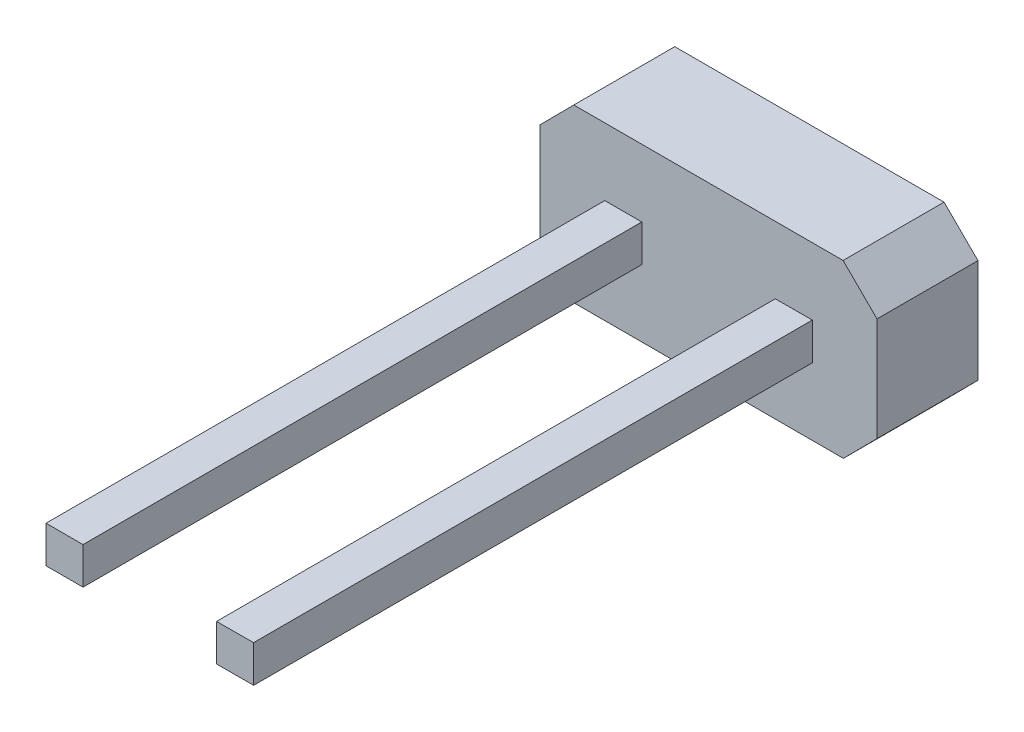
ISO-10303-21;
HEADER;
FILE_DESCRIPTION(('STEP AP214'),'2;1');
FILE_NAME('part.step','',(''),(''),'','','');
FILE_SCHEMA(('AUTOMOTIVE_DESIGN { 1 0 10303 214 1 1 1 1 }'));
ENDSEC;
DATA;
#1=APPLICATION_CONTEXT('core data for automotive mechanical design processes');
#2=APPLICATION_PROTOCOL_DEFINITION('international standard','automotive_design',2000,#1);
#3=PRODUCT_CONTEXT('',#1,'mechanical');
#4=PRODUCT('Part','Part','',(#3));
#5=PRODUCT_RELATED_PRODUCT_CATEGORY('part','',(#4));
#6=PRODUCT_DEFINITION_FORMATION('','',#4);
#7=PRODUCT_DEFINITION_CONTEXT('part definition',#1,'design');
#8=PRODUCT_DEFINITION('design','',#6,#7);
#9=PRODUCT_DEFINITION_SHAPE('','',#8);
#10=(LENGTH_UNIT() NAMED_UNIT(*) SI_UNIT(.MILLI.,.METRE.));
#11=(NAMED_UNIT(*) PLANE_ANGLE_UNIT() SI_UNIT($,.RADIAN.));
#12=(NAMED_UNIT(*) SI_UNIT($,.STERADIAN.) SOLID_ANGLE_UNIT());
#13=UNCERTAINTY_MEASURE_WITH_UNIT(LENGTH_MEASURE(1.E-05),#10,'distance_accuracy_value','');
#14=(GEOMETRIC_REPRESENTATION_CONTEXT(3) GLOBAL_UNCERTAINTY_ASSIGNED_CONTEXT((#13)) GLOBAL_UNIT_ASSIGNED_CONTEXT((#10,
#11,#12)) REPRESENTATION_CONTEXT('',''));
#15=CARTESIAN_POINT('',(0.,0.,0.));
#16=DIRECTION('',(0.,0.,1.));
#17=DIRECTION('',(1.,0.,0.));
#18=AXIS2_PLACEMENT_3D('',#15,#16,#17);
#19=CARTESIAN_POINT('',(0.,0.,1.5));
#20=DIRECTION('',(0.,0.,1.));
#21=DIRECTION('',(1.,0.,0.));
#22=AXIS2_PLACEMENT_3D('',#19,#20,#21);
#23=PLANE('',#22);
#24=DIRECTION('',(0.,-1.,0.));
#25=VECTOR('',#24,1.);
#26=CARTESIAN_POINT('',(-1.47372528281228,1.54408332644514,1.5));
#27=LINE('',#26,#25);
#28=CARTESIAN_POINT('',(-1.47372528281228,1.54408332644514,1.5));
#29=VERTEX_POINT('',#28);
#30=CARTESIAN_POINT('',(-1.47372528281228,0.995916673554858,1.5));
#31=VERTEX_POINT('',#30);
#32=EDGE_CURVE('E57',#29,#31,#27,.T.);
#33=ORIENTED_EDGE('',*,*,#32,.F.);
#34=DIRECTION('',(-1.,0.,0.));
#35=VECTOR('',#34,1.);
#36=CARTESIAN_POINT('',(-1.47372528281228,1.54408332644514,1.5));
#37=LINE('',#36,#35);
#38=CARTESIAN_POINT('',(-0.923725282812278,1.54408332644514,1.5));
#39=VERTEX_POINT('',#38);
#40=EDGE_CURVE('E182',#39,#29,#37,.T.);
#41=ORIENTED_EDGE('',*,*,#40,.F.);
#42=DIRECTION('',(0.,1.,0.));
#43=VECTOR('',#42,1.);
#44=CARTESIAN_POINT('',(-0.923725282812278,1.54408332644514,1.5));
#45=LINE('',#44,#43);
#46=CARTESIAN_POINT('',(-0.923725282812278,0.995916673554858,1.5));
#47=VERTEX_POINT('',#46);
#48=EDGE_CURVE('E191',#47,#39,#45,.T.);
#49=ORIENTED_EDGE('',*,*,#48,.F.);
#50=DIRECTION('',(1.,0.,0.));
#51=VECTOR('',#50,1.);
#52=CARTESIAN_POINT('',(-1.47372528281228,0.995916673554858,1.5));
#53=LINE('',#52,#51);
#54=EDGE_CURVE('E173',#31,#47,#53,.T.);
#55=ORIENTED_EDGE('',*,*,#54,.F.);
#56=EDGE_LOOP('',(#33,#41,#49,#55));
#57=FACE_BOUND('',#56,.T.);
#58=DIRECTION('',(0.709976516119919,-0.704225352112676,0.));
#59=VECTOR('',#58,1.);
#60=CARTESIAN_POINT('',(-2.43372528281228,0.5,1.5));
#61=LINE('',#60,#59);
#62=CARTESIAN_POINT('',(-2.43372528281228,0.5,1.5));
#63=VERTEX_POINT('',#62);
#64=CARTESIAN_POINT('',(-1.92964195636713,0.,1.5));
#65=VERTEX_POINT('',#64);
#66=EDGE_CURVE('E207',#63,#65,#61,.T.);
#67=ORIENTED_EDGE('',*,*,#66,.T.);
#68=DIRECTION('',(1.,0.,0.));
#69=VECTOR('',#68,1.);
#70=CARTESIAN_POINT('',(-1.92964195636713,0.,1.5));
#71=LINE('',#70,#69);
#72=CARTESIAN_POINT('',(2.07035804363286,0.,1.5));
#73=VERTEX_POINT('',#72);
#74=EDGE_CURVE('E210',#65,#73,#71,.T.);
#75=ORIENTED_EDGE('',*,*,#74,.T.);
#76=DIRECTION('',(0.704225352112676,0.709976516119919,0.));
#77=VECTOR('',#76,1.);
#78=CARTESIAN_POINT('',(2.07035804363286,0.,1.5));
#79=LINE('',#78,#77);
#80=CARTESIAN_POINT('',(2.57035804363286,0.504083326445142,1.5));
#81=VERTEX_POINT('',#80);
#82=EDGE_CURVE('E213',#73,#81,#79,.T.);
#83=ORIENTED_EDGE('',*,*,#82,.T.);
#84=DIRECTION('',(0.,1.,0.));
#85=VECTOR('',#84,1.);
#86=CARTESIAN_POINT('',(2.57035804363286,0.504083326445142,1.5));
#87=LINE('',#86,#85);
#88=CARTESIAN_POINT('',(2.57035804363286,2.04408332644514,1.5));
#89=VERTEX_POINT('',#88);
#90=EDGE_CURVE('E215',#81,#89,#87,.T.);
#91=ORIENTED_EDGE('',*,*,#90,.T.);
#92=DIRECTION('',(-0.709976516119919,0.704225352112676,0.));
#93=VECTOR('',#92,1.);
#94=CARTESIAN_POINT('',(2.57035804363286,2.04408332644514,1.5));
#95=LINE('',#94,#93);
#96=CARTESIAN_POINT('',(2.06627471718772,2.54408332644514,1.5));
#97=VERTEX_POINT('',#96);
#98=EDGE_CURVE('E217',#89,#97,#95,.T.);
#99=ORIENTED_EDGE('',*,*,#98,.T.);
#100=DIRECTION('',(-1.,0.,0.));
#101=VECTOR('',#100,1.);
#102=CARTESIAN_POINT('',(2.06627471718772,2.54408332644514,1.5));
#103=LINE('',#102,#101);
#104=CARTESIAN_POINT('',(-1.93372528281228,2.54408332644514,1.5));
#105=VERTEX_POINT('',#104);
#106=EDGE_CURVE('E219',#97,#105,#103,.T.);
#107=ORIENTED_EDGE('',*,*,#106,.T.);
#108=DIRECTION('',(-0.704225352112676,-0.709976516119919,0.));
#109=VECTOR('',#108,1.);
#110=CARTESIAN_POINT('',(-1.93372528281228,2.54408332644514,1.5));
#111=LINE('',#110,#109);
#112=CARTESIAN_POINT('',(-2.43372528281228,2.04,1.5));
#113=VERTEX_POINT('',#112);
#114=EDGE_CURVE('E221',#105,#113,#111,.T.);
#115=ORIENTED_EDGE('',*,*,#114,.T.);
#116=DIRECTION('',(0.,-1.,0.));
#117=VECTOR('',#116,1.);
#118=CARTESIAN_POINT('',(-2.43372528281228,2.04,1.5));
#119=LINE('',#118,#117);
#120=EDGE_CURVE('E223',#113,#63,#119,.T.);
#121=ORIENTED_EDGE('',*,*,#120,.T.);
#122=EDGE_LOOP('',(#67,#75,#83,#91,#99,#107,#115,#121));
#123=FACE_BOUND('',#122,.T.);
#124=DIRECTION('',(-0.999994847779797,-0.00321004888762787,0.));
#125=VECTOR('',#124,1.);
#126=CARTESIAN_POINT('',(1.60947683165624,1.54903195395229,1.5));
#127=LINE('',#126,#125);
#128=CARTESIAN_POINT('',(1.60947683165624,1.54903195395229,1.5));
#129=VERTEX_POINT('',#128);
#130=CARTESIAN_POINT('',(1.05947966537735,1.5472664270641,1.5));
#131=VERTEX_POINT('',#130);
#132=EDGE_CURVE('E476',#129,#131,#127,.T.);
#133=ORIENTED_EDGE('',*,*,#132,.F.);
#134=DIRECTION('',(-0.00321004888762844,0.999994847779797,0.));
#135=VECTOR('',#134,1.);
#136=CARTESIAN_POINT('',(1.60947683165624,1.54903195395229,1.5));
#137=LINE('',#136,#135);
#138=CARTESIAN_POINT('',(1.61123647341058,1.00086812533731,1.5));
#139=VERTEX_POINT('',#138);
#140=EDGE_CURVE('E170',#139,#129,#137,.T.);
#141=ORIENTED_EDGE('',*,*,#140,.F.);
#142=DIRECTION('',(0.999994847779797,0.00321004888762786,0.));
#143=VECTOR('',#142,1.);
#144=CARTESIAN_POINT('',(1.61123647341058,1.00086812533731,1.5));
#145=LINE('',#144,#143);
#146=CARTESIAN_POINT('',(1.0612393071317,0.999102598449117,1.5));
#147=VERTEX_POINT('',#146);
#148=EDGE_CURVE('E166',#147,#139,#145,.T.);
#149=ORIENTED_EDGE('',*,*,#148,.F.);
#150=DIRECTION('',(0.00321004888762765,-0.999994847779797,0.));
#151=VECTOR('',#150,1.);
#152=CARTESIAN_POINT('',(1.05947966537735,1.5472664270641,1.5));
#153=LINE('',#152,#151);
#154=EDGE_CURVE('E473',#131,#147,#153,.T.);
#155=ORIENTED_EDGE('',*,*,#154,.F.);
#156=EDGE_LOOP('',(#133,#141,#149,#155));
#157=FACE_BOUND('',#156,.T.);
#158=ADVANCED_FACE('F34',(#57,#123,#157),#23,.T.);
#159=CARTESIAN_POINT('',(-2.43372528281228,0.5,1.5));
#160=DIRECTION('',(0.704225352112676,0.709976516119919,0.));
#161=DIRECTION('',(-0.709976516119919,0.704225352112676,0.));
#162=AXIS2_PLACEMENT_3D('',#159,#160,#161);
#163=PLANE('',#162);
#164=DIRECTION('',(0.709976516119919,-0.704225352112676,0.));
#165=VECTOR('',#164,1.);
#166=CARTESIAN_POINT('',(-2.43372528281228,0.5,0.));
#167=LINE('',#166,#165);
#168=CARTESIAN_POINT('',(-2.43372528281228,0.5,0.));
#169=VERTEX_POINT('',#168);
#170=CARTESIAN_POINT('',(-1.92964195636713,0.,0.));
#171=VERTEX_POINT('',#170);
#172=EDGE_CURVE('E206',#169,#171,#167,.T.);
#173=ORIENTED_EDGE('',*,*,#172,.T.);
#174=DIRECTION('',(0.,0.,-1.));
#175=VECTOR('',#174,1.);
#176=CARTESIAN_POINT('',(-1.92964195636713,0.,1.5));
#177=LINE('',#176,#175);
#178=EDGE_CURVE('E11',#65,#171,#177,.T.);
#179=ORIENTED_EDGE('',*,*,#178,.F.);
#180=ORIENTED_EDGE('',*,*,#66,.F.);
#181=DIRECTION('',(0.,0.,-1.));
#182=VECTOR('',#181,1.);
#183=CARTESIAN_POINT('',(-2.43372528281228,0.5,1.5));
#184=LINE('',#183,#182);
#185=EDGE_CURVE('E225',#63,#169,#184,.T.);
#186=ORIENTED_EDGE('',*,*,#185,.T.);
#187=EDGE_LOOP('',(#173,#179,#180,#186));
#188=FACE_BOUND('',#187,.T.);
#189=ADVANCED_FACE('F36',(#188),#163,.F.);
#190=CARTESIAN_POINT('',(-1.92964195636713,0.,1.5));
#191=DIRECTION('',(0.,1.,0.));
#192=DIRECTION('',(0.,0.,1.));
#193=AXIS2_PLACEMENT_3D('',#190,#191,#192);
#194=PLANE('',#193);
#195=DIRECTION('',(1.,0.,0.));
#196=VECTOR('',#195,1.);
#197=CARTESIAN_POINT('',(-1.92964195636713,0.,0.));
#198=LINE('',#197,#196);
#199=CARTESIAN_POINT('',(2.07035804363286,0.,0.));
#200=VERTEX_POINT('',#199);
#201=EDGE_CURVE('E228',#171,#200,#198,.T.);
#202=ORIENTED_EDGE('',*,*,#201,.T.);
#203=DIRECTION('',(0.,0.,-1.));
#204=VECTOR('',#203,1.);
#205=CARTESIAN_POINT('',(2.07035804363286,0.,1.5));
#206=LINE('',#205,#204);
#207=EDGE_CURVE('E42',#73,#200,#206,.T.);
#208=ORIENTED_EDGE('',*,*,#207,.F.);
#209=ORIENTED_EDGE('',*,*,#74,.F.);
#210=ORIENTED_EDGE('',*,*,#178,.T.);
#211=EDGE_LOOP('',(#202,#208,#209,#210));
#212=FACE_BOUND('',#211,.T.);
#213=ADVANCED_FACE('F285',(#212),#194,.F.);
#214=CARTESIAN_POINT('',(2.07035804363286,0.,1.5));
#215=DIRECTION('',(-0.709976516119919,0.704225352112676,0.));
#216=DIRECTION('',(-0.704225352112676,-0.709976516119919,0.));
#217=AXIS2_PLACEMENT_3D('',#214,#215,#216);
#218=PLANE('',#217);
#219=DIRECTION('',(0.704225352112676,0.709976516119919,0.));
#220=VECTOR('',#219,1.);
#221=CARTESIAN_POINT('',(2.07035804363286,0.,0.));
#222=LINE('',#221,#220);
#223=CARTESIAN_POINT('',(2.57035804363286,0.504083326445142,0.));
#224=VERTEX_POINT('',#223);
#225=EDGE_CURVE('E230',#200,#224,#222,.T.);
#226=ORIENTED_EDGE('',*,*,#225,.T.);
#227=DIRECTION('',(0.,0.,-1.));
#228=VECTOR('',#227,1.);
#229=CARTESIAN_POINT('',(2.57035804363286,0.504083326445142,1.5));
#230=LINE('',#229,#228);
#231=EDGE_CURVE('E255',#81,#224,#230,.T.);
#232=ORIENTED_EDGE('',*,*,#231,.F.);
#233=ORIENTED_EDGE('',*,*,#82,.F.);
#234=ORIENTED_EDGE('',*,*,#207,.T.);
#235=EDGE_LOOP('',(#226,#232,#233,#234));
#236=FACE_BOUND('',#235,.T.);
#237=ADVANCED_FACE('F262',(#236),#218,.F.);
#238=CARTESIAN_POINT('',(2.57035804363286,0.504083326445142,1.5));
#239=DIRECTION('',(-1.,0.,0.));
#240=DIRECTION('',(0.,0.,1.));
#241=AXIS2_PLACEMENT_3D('',#238,#239,#240);
#242=PLANE('',#241);
#243=DIRECTION('',(0.,1.,0.));
#244=VECTOR('',#243,1.);
#245=CARTESIAN_POINT('',(2.57035804363286,0.504083326445142,0.));
#246=LINE('',#245,#244);
#247=CARTESIAN_POINT('',(2.57035804363286,2.04408332644514,0.));
#248=VERTEX_POINT('',#247);
#249=EDGE_CURVE('E232',#224,#248,#246,.T.);
#250=ORIENTED_EDGE('',*,*,#249,.T.);
#251=DIRECTION('',(0.,0.,-1.));
#252=VECTOR('',#251,1.);
#253=CARTESIAN_POINT('',(2.57035804363286,2.04408332644514,1.5));
#254=LINE('',#253,#252);
#255=EDGE_CURVE('E252',#89,#248,#254,.T.);
#256=ORIENTED_EDGE('',*,*,#255,.F.);
#257=ORIENTED_EDGE('',*,*,#90,.F.);
#258=ORIENTED_EDGE('',*,*,#231,.T.);
#259=EDGE_LOOP('',(#250,#256,#257,#258));
#260=FACE_BOUND('',#259,.T.);
#261=ADVANCED_FACE('F273',(#260),#242,.F.);
#262=CARTESIAN_POINT('',(2.57035804363286,2.04408332644514,1.5));
#263=DIRECTION('',(-0.704225352112676,-0.709976516119919,0.));
#264=DIRECTION('',(0.709976516119919,-0.704225352112676,0.));
#265=AXIS2_PLACEMENT_3D('',#262,#263,#264);
#266=PLANE('',#265);
#267=DIRECTION('',(-0.709976516119919,0.704225352112676,0.));
#268=VECTOR('',#267,1.);
#269=CARTESIAN_POINT('',(2.57035804363286,2.04408332644514,0.));
#270=LINE('',#269,#268);
#271=CARTESIAN_POINT('',(2.06627471718772,2.54408332644514,0.));
#272=VERTEX_POINT('',#271);
#273=EDGE_CURVE('E234',#248,#272,#270,.T.);
#274=ORIENTED_EDGE('',*,*,#273,.T.);
#275=DIRECTION('',(0.,0.,-1.));
#276=VECTOR('',#275,1.);
#277=CARTESIAN_POINT('',(2.06627471718772,2.54408332644514,1.5));
#278=LINE('',#277,#276);
#279=EDGE_CURVE('E249',#97,#272,#278,.T.);
#280=ORIENTED_EDGE('',*,*,#279,.F.);
#281=ORIENTED_EDGE('',*,*,#98,.F.);
#282=ORIENTED_EDGE('',*,*,#255,.T.);
#283=EDGE_LOOP('',(#274,#280,#281,#282));
#284=FACE_BOUND('',#283,.T.);
#285=ADVANCED_FACE('F277',(#284),#266,.F.);
#286=CARTESIAN_POINT('',(2.06627471718772,2.54408332644514,1.5));
#287=DIRECTION('',(0.,-1.,0.));
#288=DIRECTION('',(0.,0.,-1.));
#289=AXIS2_PLACEMENT_3D('',#286,#287,#288);
#290=PLANE('',#289);
#291=DIRECTION('',(-1.,0.,0.));
#292=VECTOR('',#291,1.);
#293=CARTESIAN_POINT('',(2.06627471718772,2.54408332644514,0.));
#294=LINE('',#293,#292);
#295=CARTESIAN_POINT('',(-1.93372528281228,2.54408332644514,0.));
#296=VERTEX_POINT('',#295);
#297=EDGE_CURVE('E236',#272,#296,#294,.T.);
#298=ORIENTED_EDGE('',*,*,#297,.T.);
#299=DIRECTION('',(0.,0.,-1.));
#300=VECTOR('',#299,1.);
#301=CARTESIAN_POINT('',(-1.93372528281228,2.54408332644514,1.5));
#302=LINE('',#301,#300);
#303=EDGE_CURVE('E246',#105,#296,#302,.T.);
#304=ORIENTED_EDGE('',*,*,#303,.F.);
#305=ORIENTED_EDGE('',*,*,#106,.F.);
#306=ORIENTED_EDGE('',*,*,#279,.T.);
#307=EDGE_LOOP('',(#298,#304,#305,#306));
#308=FACE_BOUND('',#307,.T.);
#309=ADVANCED_FACE('F298',(#308),#290,.F.);
#310=CARTESIAN_POINT('',(-1.93372528281228,2.54408332644514,1.5));
#311=DIRECTION('',(0.709976516119919,-0.704225352112676,0.));
#312=DIRECTION('',(0.704225352112676,0.709976516119919,0.));
#313=AXIS2_PLACEMENT_3D('',#310,#311,#312);
#314=PLANE('',#313);
#315=DIRECTION('',(-0.704225352112676,-0.709976516119919,0.));
#316=VECTOR('',#315,1.);
#317=CARTESIAN_POINT('',(-1.93372528281228,2.54408332644514,0.));
#318=LINE('',#317,#316);
#319=CARTESIAN_POINT('',(-2.43372528281228,2.04,0.));
#320=VERTEX_POINT('',#319);
#321=EDGE_CURVE('E238',#296,#320,#318,.T.);
#322=ORIENTED_EDGE('',*,*,#321,.T.);
#323=DIRECTION('',(0.,0.,-1.));
#324=VECTOR('',#323,1.);
#325=CARTESIAN_POINT('',(-2.43372528281228,2.04,1.5));
#326=LINE('',#325,#324);
#327=EDGE_CURVE('E243',#113,#320,#326,.T.);
#328=ORIENTED_EDGE('',*,*,#327,.F.);
#329=ORIENTED_EDGE('',*,*,#114,.F.);
#330=ORIENTED_EDGE('',*,*,#303,.T.);
#331=EDGE_LOOP('',(#322,#328,#329,#330));
#332=FACE_BOUND('',#331,.T.);
#333=ADVANCED_FACE('F296',(#332),#314,.F.);
#334=CARTESIAN_POINT('',(-2.43372528281228,2.04,1.5));
#335=DIRECTION('',(1.,0.,0.));
#336=DIRECTION('',(0.,0.,-1.));
#337=AXIS2_PLACEMENT_3D('',#334,#335,#336);
#338=PLANE('',#337);
#339=DIRECTION('',(0.,-1.,0.));
#340=VECTOR('',#339,1.);
#341=CARTESIAN_POINT('',(-2.43372528281228,2.04,0.));
#342=LINE('',#341,#340);
#343=EDGE_CURVE('E211',#320,#169,#342,.T.);
#344=ORIENTED_EDGE('',*,*,#343,.T.);
#345=ORIENTED_EDGE('',*,*,#185,.F.);
#346=ORIENTED_EDGE('',*,*,#120,.F.);
#347=ORIENTED_EDGE('',*,*,#327,.T.);
#348=EDGE_LOOP('',(#344,#345,#346,#347));
#349=FACE_BOUND('',#348,.T.);
#350=ADVANCED_FACE('F291',(#349),#338,.F.);
#351=CARTESIAN_POINT('',(0.,0.,0.));
#352=DIRECTION('',(0.,0.,1.));
#353=DIRECTION('',(1.,0.,0.));
#354=AXIS2_PLACEMENT_3D('',#351,#352,#353);
#355=PLANE('',#354);
#356=ORIENTED_EDGE('',*,*,#172,.F.);
#357=ORIENTED_EDGE('',*,*,#343,.F.);
#358=ORIENTED_EDGE('',*,*,#321,.F.);
#359=ORIENTED_EDGE('',*,*,#297,.F.);
#360=ORIENTED_EDGE('',*,*,#273,.F.);
#361=ORIENTED_EDGE('',*,*,#249,.F.);
#362=ORIENTED_EDGE('',*,*,#225,.F.);
#363=ORIENTED_EDGE('',*,*,#201,.F.);
#364=EDGE_LOOP('',(#356,#357,#358,#359,#360,#361,#362,#363));
#365=FACE_BOUND('',#364,.T.);
#366=ADVANCED_FACE('F268',(#365),#355,.F.);
#367=CARTESIAN_POINT('',(-1.47372528281228,1.54408332644514,9.8));
#368=DIRECTION('',(1.,0.,0.));
#369=DIRECTION('',(0.,0.,-1.));
#370=AXIS2_PLACEMENT_3D('',#367,#368,#369);
#371=PLANE('',#370);
#372=ORIENTED_EDGE('',*,*,#32,.T.);
#373=DIRECTION('',(0.,0.,-1.));
#374=VECTOR('',#373,1.);
#375=CARTESIAN_POINT('',(-1.47372528281228,0.995916673554858,9.8));
#376=LINE('',#375,#374);
#377=CARTESIAN_POINT('',(-1.47372528281228,0.995916673554858,9.8));
#378=VERTEX_POINT('',#377);
#379=EDGE_CURVE('E203',#378,#31,#376,.T.);
#380=ORIENTED_EDGE('',*,*,#379,.F.);
#381=DIRECTION('',(0.,-1.,0.));
#382=VECTOR('',#381,1.);
#383=CARTESIAN_POINT('',(-1.47372528281228,1.54408332644514,9.8));
#384=LINE('',#383,#382);
#385=CARTESIAN_POINT('',(-1.47372528281228,1.54408332644514,9.8));
#386=VERTEX_POINT('',#385);
#387=EDGE_CURVE('E178',#386,#378,#384,.T.);
#388=ORIENTED_EDGE('',*,*,#387,.F.);
#389=DIRECTION('',(0.,0.,-1.));
#390=VECTOR('',#389,1.);
#391=CARTESIAN_POINT('',(-1.47372528281228,1.54408332644514,9.8));
#392=LINE('',#391,#390);
#393=EDGE_CURVE('E187',#386,#29,#392,.T.);
#394=ORIENTED_EDGE('',*,*,#393,.T.);
#395=EDGE_LOOP('',(#372,#380,#388,#394));
#396=FACE_BOUND('',#395,.T.);
#397=ADVANCED_FACE('F314',(#396),#371,.F.);
#398=CARTESIAN_POINT('',(-1.47372528281228,0.995916673554858,9.8));
#399=DIRECTION('',(0.,1.,0.));
#400=DIRECTION('',(0.,0.,1.));
#401=AXIS2_PLACEMENT_3D('',#398,#399,#400);
#402=PLANE('',#401);
#403=ORIENTED_EDGE('',*,*,#54,.T.);
#404=DIRECTION('',(0.,0.,-1.));
#405=VECTOR('',#404,1.);
#406=CARTESIAN_POINT('',(-0.923725282812278,0.995916673554858,9.8));
#407=LINE('',#406,#405);
#408=CARTESIAN_POINT('',(-0.923725282812278,0.995916673554858,9.8));
#409=VERTEX_POINT('',#408);
#410=EDGE_CURVE('E200',#409,#47,#407,.T.);
#411=ORIENTED_EDGE('',*,*,#410,.F.);
#412=DIRECTION('',(1.,0.,0.));
#413=VECTOR('',#412,1.);
#414=CARTESIAN_POINT('',(-1.47372528281228,0.995916673554858,9.8));
#415=LINE('',#414,#413);
#416=EDGE_CURVE('E181',#378,#409,#415,.T.);
#417=ORIENTED_EDGE('',*,*,#416,.F.);
#418=ORIENTED_EDGE('',*,*,#379,.T.);
#419=EDGE_LOOP('',(#403,#411,#417,#418));
#420=FACE_BOUND('',#419,.T.);
#421=ADVANCED_FACE('F333',(#420),#402,.F.);
#422=CARTESIAN_POINT('',(-0.923725282812278,1.54408332644514,9.8));
#423=DIRECTION('',(-1.,0.,0.));
#424=DIRECTION('',(0.,0.,1.));
#425=AXIS2_PLACEMENT_3D('',#422,#423,#424);
#426=PLANE('',#425);
#427=ORIENTED_EDGE('',*,*,#48,.T.);
#428=DIRECTION('',(0.,0.,-1.));
#429=VECTOR('',#428,1.);
#430=CARTESIAN_POINT('',(-0.923725282812278,1.54408332644514,9.8));
#431=LINE('',#430,#429);
#432=CARTESIAN_POINT('',(-0.923725282812278,1.54408332644514,9.8));
#433=VERTEX_POINT('',#432);
#434=EDGE_CURVE('E197',#433,#39,#431,.T.);
#435=ORIENTED_EDGE('',*,*,#434,.F.);
#436=DIRECTION('',(0.,1.,0.));
#437=VECTOR('',#436,1.);
#438=CARTESIAN_POINT('',(-0.923725282812278,1.54408332644514,9.8));
#439=LINE('',#438,#437);
#440=EDGE_CURVE('E184',#409,#433,#439,.T.);
#441=ORIENTED_EDGE('',*,*,#440,.F.);
#442=ORIENTED_EDGE('',*,*,#410,.T.);
#443=EDGE_LOOP('',(#427,#435,#441,#442));
#444=FACE_BOUND('',#443,.T.);
#445=ADVANCED_FACE('F340',(#444),#426,.F.);
#446=CARTESIAN_POINT('',(-1.47372528281228,1.54408332644514,9.8));
#447=DIRECTION('',(0.,-1.,0.));
#448=DIRECTION('',(0.,0.,-1.));
#449=AXIS2_PLACEMENT_3D('',#446,#447,#448);
#450=PLANE('',#449);
#451=ORIENTED_EDGE('',*,*,#40,.T.);
#452=ORIENTED_EDGE('',*,*,#393,.F.);
#453=DIRECTION('',(-1.,0.,0.));
#454=VECTOR('',#453,1.);
#455=CARTESIAN_POINT('',(-1.47372528281228,1.54408332644514,9.8));
#456=LINE('',#455,#454);
#457=EDGE_CURVE('E186',#433,#386,#456,.T.);
#458=ORIENTED_EDGE('',*,*,#457,.F.);
#459=ORIENTED_EDGE('',*,*,#434,.T.);
#460=EDGE_LOOP('',(#451,#452,#458,#459));
#461=FACE_BOUND('',#460,.T.);
#462=ADVANCED_FACE('F347',(#461),#450,.F.);
#463=CARTESIAN_POINT('',(0.,0.,9.8));
#464=DIRECTION('',(0.,0.,1.));
#465=DIRECTION('',(1.,0.,0.));
#466=AXIS2_PLACEMENT_3D('',#463,#464,#465);
#467=PLANE('',#466);
#468=ORIENTED_EDGE('',*,*,#387,.T.);
#469=ORIENTED_EDGE('',*,*,#416,.T.);
#470=ORIENTED_EDGE('',*,*,#440,.T.);
#471=ORIENTED_EDGE('',*,*,#457,.T.);
#472=EDGE_LOOP('',(#468,#469,#470,#471));
#473=FACE_BOUND('',#472,.T.);
#474=ADVANCED_FACE('F355',(#473),#467,.T.);
#475=CARTESIAN_POINT('',(1.60947683165624,1.54903195395229,9.8));
#476=DIRECTION('',(-0.999994847779797,-0.00321004888762844,0.));
#477=DIRECTION('',(0.00321004888762844,-0.999994847779797,0.));
#478=AXIS2_PLACEMENT_3D('',#475,#476,#477);
#479=PLANE('',#478);
#480=ORIENTED_EDGE('',*,*,#140,.T.);
#481=DIRECTION('',(0.,0.,-1.));
#482=VECTOR('',#481,1.);
#483=CARTESIAN_POINT('',(1.60947683165624,1.54903195395229,9.8));
#484=LINE('',#483,#482);
#485=CARTESIAN_POINT('',(1.60947683165624,1.54903195395229,9.8));
#486=VERTEX_POINT('',#485);
#487=EDGE_CURVE('E151',#486,#129,#484,.T.);
#488=ORIENTED_EDGE('',*,*,#487,.F.);
#489=DIRECTION('',(-0.00321004888762844,0.999994847779797,0.));
#490=VECTOR('',#489,1.);
#491=CARTESIAN_POINT('',(1.60947683165624,1.54903195395229,9.8));
#492=LINE('',#491,#490);
#493=CARTESIAN_POINT('',(1.61123647341058,1.00086812533731,9.8));
#494=VERTEX_POINT('',#493);
#495=EDGE_CURVE('E158',#494,#486,#492,.T.);
#496=ORIENTED_EDGE('',*,*,#495,.F.);
#497=DIRECTION('',(0.,0.,-1.));
#498=VECTOR('',#497,1.);
#499=CARTESIAN_POINT('',(1.61123647341058,1.00086812533731,9.8));
#500=LINE('',#499,#498);
#501=EDGE_CURVE('E471',#494,#139,#500,.T.);
#502=ORIENTED_EDGE('',*,*,#501,.T.);
#503=EDGE_LOOP('',(#480,#488,#496,#502));
#504=FACE_BOUND('',#503,.T.);
#505=ADVANCED_FACE('F168',(#504),#479,.F.);
#506=CARTESIAN_POINT('',(1.60947683165624,1.54903195395229,9.8));
#507=DIRECTION('',(0.00321004888762787,-0.999994847779797,0.));
#508=DIRECTION('',(0.999994847779797,0.00321004888762787,0.));
#509=AXIS2_PLACEMENT_3D('',#506,#507,#508);
#510=PLANE('',#509);
#511=ORIENTED_EDGE('',*,*,#132,.T.);
#512=DIRECTION('',(0.,0.,-1.));
#513=VECTOR('',#512,1.);
#514=CARTESIAN_POINT('',(1.05947966537735,1.5472664270641,9.8));
#515=LINE('',#514,#513);
#516=CARTESIAN_POINT('',(1.05947966537735,1.5472664270641,9.8));
#517=VERTEX_POINT('',#516);
#518=EDGE_CURVE('E154',#517,#131,#515,.T.);
#519=ORIENTED_EDGE('',*,*,#518,.F.);
#520=DIRECTION('',(-0.999994847779797,-0.00321004888762787,0.));
#521=VECTOR('',#520,1.);
#522=CARTESIAN_POINT('',(1.60947683165624,1.54903195395229,9.8));
#523=LINE('',#522,#521);
#524=EDGE_CURVE('E147',#486,#517,#523,.T.);
#525=ORIENTED_EDGE('',*,*,#524,.F.);
#526=ORIENTED_EDGE('',*,*,#487,.T.);
#527=EDGE_LOOP('',(#511,#519,#525,#526));
#528=FACE_BOUND('',#527,.T.);
#529=ADVANCED_FACE('F149',(#528),#510,.F.);
#530=CARTESIAN_POINT('',(1.05947966537735,1.5472664270641,9.8));
#531=DIRECTION('',(0.999994847779797,0.00321004888762765,0.));
#532=DIRECTION('',(-0.00321004888762765,0.999994847779797,0.));
#533=AXIS2_PLACEMENT_3D('',#530,#531,#532);
#534=PLANE('',#533);
#535=ORIENTED_EDGE('',*,*,#154,.T.);
#536=DIRECTION('',(0.,0.,-1.));
#537=VECTOR('',#536,1.);
#538=CARTESIAN_POINT('',(1.0612393071317,0.999102598449117,9.8));
#539=LINE('',#538,#537);
#540=CARTESIAN_POINT('',(1.0612393071317,0.999102598449117,9.8));
#541=VERTEX_POINT('',#540);
#542=EDGE_CURVE('E49',#541,#147,#539,.T.);
#543=ORIENTED_EDGE('',*,*,#542,.F.);
#544=DIRECTION('',(0.00321004888762765,-0.999994847779797,0.));
#545=VECTOR('',#544,1.);
#546=CARTESIAN_POINT('',(1.05947966537735,1.5472664270641,9.8));
#547=LINE('',#546,#545);
#548=EDGE_CURVE('E157',#517,#541,#547,.T.);
#549=ORIENTED_EDGE('',*,*,#548,.F.);
#550=ORIENTED_EDGE('',*,*,#518,.T.);
#551=EDGE_LOOP('',(#535,#543,#549,#550));
#552=FACE_BOUND('',#551,.T.);
#553=ADVANCED_FACE('F376',(#552),#534,.F.);
#554=CARTESIAN_POINT('',(1.61123647341058,1.00086812533731,9.8));
#555=DIRECTION('',(-0.00321004888762787,0.999994847779797,0.));
#556=DIRECTION('',(-0.999994847779797,-0.00321004888762787,0.));
#557=AXIS2_PLACEMENT_3D('',#554,#555,#556);
#558=PLANE('',#557);
#559=ORIENTED_EDGE('',*,*,#148,.T.);
#560=ORIENTED_EDGE('',*,*,#501,.F.);
#561=DIRECTION('',(0.999994847779797,0.00321004888762786,0.));
#562=VECTOR('',#561,1.);
#563=CARTESIAN_POINT('',(1.61123647341058,1.00086812533731,9.8));
#564=LINE('',#563,#562);
#565=EDGE_CURVE('E162',#541,#494,#564,.T.);
#566=ORIENTED_EDGE('',*,*,#565,.F.);
#567=ORIENTED_EDGE('',*,*,#542,.T.);
#568=EDGE_LOOP('',(#559,#560,#566,#567));
#569=FACE_BOUND('',#568,.T.);
#570=ADVANCED_FACE('F383',(#569),#558,.F.);
#571=CARTESIAN_POINT('',(0.,0.,9.8));
#572=DIRECTION('',(0.,0.,-1.));
#573=DIRECTION('',(-1.,0.,0.));
#574=AXIS2_PLACEMENT_3D('',#571,#572,#573);
#575=PLANE('',#574);
#576=ORIENTED_EDGE('',*,*,#495,.T.);
#577=ORIENTED_EDGE('',*,*,#524,.T.);
#578=ORIENTED_EDGE('',*,*,#548,.T.);
#579=ORIENTED_EDGE('',*,*,#565,.T.);
#580=EDGE_LOOP('',(#576,#577,#578,#579));
#581=FACE_BOUND('',#580,.T.);
#582=ADVANCED_FACE('F161',(#581),#575,.F.);
#583=CLOSED_SHELL('',(#158,#189,#213,#237,#261,#285,#309,#333,#350,#366,#397,#421,#445,#462,
#474,#505,#529,#553,#570,#582));
#584=MANIFOLD_SOLID_BREP('B2',#583);
#585=ADVANCED_BREP_SHAPE_REPRESENTATION('',(#18,#584),#14);
#586=SHAPE_DEFINITION_REPRESENTATION(#9,#585);
ENDSEC;
END-ISO-10303-21;
